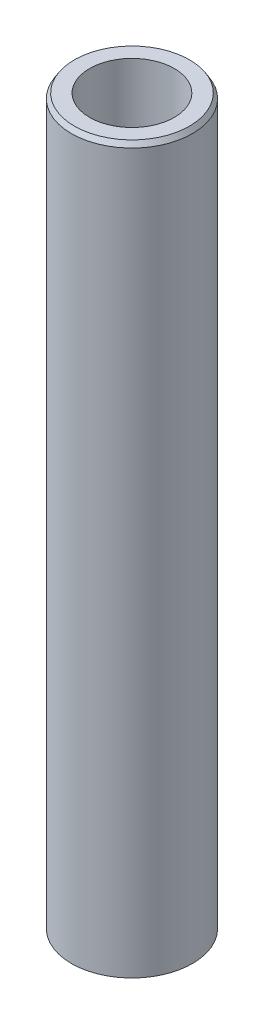
ISO-10303-21;
HEADER;
FILE_DESCRIPTION(('STEP AP214'),'2;1');
FILE_NAME('part.step','',(''),(''),'','','');
FILE_SCHEMA(('AUTOMOTIVE_DESIGN { 1 0 10303 214 1 1 1 1 }'));
ENDSEC;
DATA;
#1=APPLICATION_CONTEXT('core data for automotive mechanical design processes');
#2=APPLICATION_PROTOCOL_DEFINITION('international standard','automotive_design',2000,#1);
#3=PRODUCT_CONTEXT('',#1,'mechanical');
#4=PRODUCT('Part','Part','',(#3));
#5=PRODUCT_RELATED_PRODUCT_CATEGORY('part','',(#4));
#6=PRODUCT_DEFINITION_FORMATION('','',#4);
#7=PRODUCT_DEFINITION_CONTEXT('part definition',#1,'design');
#8=PRODUCT_DEFINITION('design','',#6,#7);
#9=PRODUCT_DEFINITION_SHAPE('','',#8);
#10=(LENGTH_UNIT() NAMED_UNIT(*) SI_UNIT(.MILLI.,.METRE.));
#11=(NAMED_UNIT(*) PLANE_ANGLE_UNIT() SI_UNIT($,.RADIAN.));
#12=(NAMED_UNIT(*) SI_UNIT($,.STERADIAN.) SOLID_ANGLE_UNIT());
#13=UNCERTAINTY_MEASURE_WITH_UNIT(LENGTH_MEASURE(1.E-05),#10,'distance_accuracy_value','');
#14=(GEOMETRIC_REPRESENTATION_CONTEXT(3) GLOBAL_UNCERTAINTY_ASSIGNED_CONTEXT((#13)) GLOBAL_UNIT_ASSIGNED_CONTEXT((#10,
#11,#12)) REPRESENTATION_CONTEXT('',''));
#15=CARTESIAN_POINT('',(0.,0.,0.));
#16=DIRECTION('',(0.,0.,1.));
#17=DIRECTION('',(1.,0.,0.));
#18=AXIS2_PLACEMENT_3D('',#15,#16,#17);
#19=CARTESIAN_POINT('',(0.,600.,0.));
#20=DIRECTION('',(0.,-1.,0.));
#21=DIRECTION('',(0.,0.,-1.));
#22=AXIS2_PLACEMENT_3D('',#19,#20,#21);
#23=CYLINDRICAL_SURFACE('',#22,50.);
#24=CARTESIAN_POINT('',(0.,595.939980837009,0.));
#25=DIRECTION('',(0.,1.,0.));
#26=DIRECTION('',(0.,0.,1.));
#27=AXIS2_PLACEMENT_3D('',#24,#25,#26);
#28=CIRCLE('',#27,50.);
#29=CARTESIAN_POINT('',(0.,595.939980837009,50.));
#30=VERTEX_POINT('',#29);
#31=EDGE_CURVE('E50',#30,#30,#28,.F.);
#32=ORIENTED_EDGE('',*,*,#31,.T.);
#33=EDGE_LOOP('',(#32));
#34=FACE_BOUND('',#33,.T.);
#35=CARTESIAN_POINT('',(0.,2.50672560015208,0.));
#36=DIRECTION('',(0.,1.,0.));
#37=DIRECTION('',(0.,0.,1.));
#38=AXIS2_PLACEMENT_3D('',#35,#36,#37);
#39=CIRCLE('',#38,50.);
#40=CARTESIAN_POINT('',(0.,2.50672560015208,50.));
#41=VERTEX_POINT('',#40);
#42=EDGE_CURVE('E51',#41,#41,#39,.T.);
#43=ORIENTED_EDGE('',*,*,#42,.T.);
#44=EDGE_LOOP('',(#43));
#45=FACE_BOUND('',#44,.T.);
#46=ADVANCED_FACE('F39',(#34,#45),#23,.T.);
#47=CARTESIAN_POINT('',(0.,600.,0.));
#48=DIRECTION('',(0.,1.,0.));
#49=DIRECTION('',(0.,0.,1.));
#50=AXIS2_PLACEMENT_3D('',#47,#48,#49);
#51=PLANE('',#50);
#52=CARTESIAN_POINT('',(0.,600.,0.));
#53=DIRECTION('',(0.,1.,0.));
#54=DIRECTION('',(0.,0.,1.));
#55=AXIS2_PLACEMENT_3D('',#52,#53,#54);
#56=CIRCLE('',#55,47.493274399848);
#57=CARTESIAN_POINT('',(0.,600.,47.493274399848));
#58=VERTEX_POINT('',#57);
#59=EDGE_CURVE('E54',#58,#58,#56,.T.);
#60=ORIENTED_EDGE('',*,*,#59,.T.);
#61=EDGE_LOOP('',(#60));
#62=FACE_BOUND('',#61,.T.);
#63=CARTESIAN_POINT('',(0.,600.,0.));
#64=DIRECTION('',(0.,1.,0.));
#65=DIRECTION('',(0.,0.,1.));
#66=AXIS2_PLACEMENT_3D('',#63,#64,#65);
#67=CIRCLE('',#66,34.9818370830786);
#68=CARTESIAN_POINT('',(0.,600.,34.9818370830786));
#69=VERTEX_POINT('',#68);
#70=EDGE_CURVE('E58',#69,#69,#67,.T.);
#71=ORIENTED_EDGE('',*,*,#70,.F.);
#72=EDGE_LOOP('',(#71));
#73=FACE_BOUND('',#72,.T.);
#74=ADVANCED_FACE('F69',(#62,#73),#51,.T.);
#75=CARTESIAN_POINT('',(0.,0.,0.));
#76=DIRECTION('',(0.,1.,0.));
#77=DIRECTION('',(0.,0.,1.));
#78=AXIS2_PLACEMENT_3D('',#75,#76,#77);
#79=PLANE('',#78);
#80=CARTESIAN_POINT('',(0.,0.,0.));
#81=DIRECTION('',(0.,1.,0.));
#82=DIRECTION('',(0.,0.,1.));
#83=AXIS2_PLACEMENT_3D('',#80,#81,#82);
#84=CIRCLE('',#83,45.9399808370092);
#85=CARTESIAN_POINT('',(0.,0.,45.9399808370092));
#86=VERTEX_POINT('',#85);
#87=EDGE_CURVE('E10',#86,#86,#84,.F.);
#88=ORIENTED_EDGE('',*,*,#87,.T.);
#89=EDGE_LOOP('',(#88));
#90=FACE_BOUND('',#89,.T.);
#91=CARTESIAN_POINT('',(0.,0.,0.));
#92=DIRECTION('',(0.,1.,0.));
#93=DIRECTION('',(0.,0.,1.));
#94=AXIS2_PLACEMENT_3D('',#91,#92,#93);
#95=CIRCLE('',#94,34.9818370830786);
#96=CARTESIAN_POINT('',(0.,0.,34.9818370830786));
#97=VERTEX_POINT('',#96);
#98=EDGE_CURVE('E63',#97,#97,#95,.T.);
#99=ORIENTED_EDGE('',*,*,#98,.T.);
#100=EDGE_LOOP('',(#99));
#101=FACE_BOUND('',#100,.T.);
#102=ADVANCED_FACE('F75',(#90,#101),#79,.F.);
#103=CARTESIAN_POINT('',(0.,600.,0.));
#104=DIRECTION('',(0.,-1.,0.));
#105=DIRECTION('',(0.,0.,-1.));
#106=AXIS2_PLACEMENT_3D('',#103,#104,#105);
#107=CYLINDRICAL_SURFACE('',#106,34.9818370830786);
#108=ORIENTED_EDGE('',*,*,#70,.T.);
#109=EDGE_LOOP('',(#108));
#110=FACE_BOUND('',#109,.T.);
#111=ORIENTED_EDGE('',*,*,#98,.F.);
#112=EDGE_LOOP('',(#111));
#113=FACE_BOUND('',#112,.T.);
#114=ADVANCED_FACE('F70',(#110,#113),#107,.F.);
#115=CARTESIAN_POINT('',(0.,600.,0.));
#116=DIRECTION('',(0.,-1.,0.));
#117=DIRECTION('',(0.,0.,-1.));
#118=AXIS2_PLACEMENT_3D('',#115,#116,#117);
#119=CONICAL_SURFACE('',#118,47.493274399848,0.553127911944052);
#120=ORIENTED_EDGE('',*,*,#31,.F.);
#121=EDGE_LOOP('',(#120));
#122=FACE_BOUND('',#121,.T.);
#123=ORIENTED_EDGE('',*,*,#59,.F.);
#124=EDGE_LOOP('',(#123));
#125=FACE_BOUND('',#124,.T.);
#126=ADVANCED_FACE('F81',(#122,#125),#119,.T.);
#127=CARTESIAN_POINT('',(0.,2.50672560015208,0.));
#128=DIRECTION('',(0.,1.,0.));
#129=DIRECTION('',(0.,0.,1.));
#130=AXIS2_PLACEMENT_3D('',#127,#128,#129);
#131=CONICAL_SURFACE('',#130,50.,1.01766841485085);
#132=CARTESIAN_POINT('',(0.,0.,45.9399808370092));
#133=CARTESIAN_POINT('',(0.,0.0261117250015845,45.9822727032903));
#134=CARTESIAN_POINT('',(0.,0.0522234500031686,46.0245645695715));
#135=CARTESIAN_POINT('',(0.,0.104446900006337,46.1091483021338));
#136=CARTESIAN_POINT('',(0.,0.130558625007921,46.1514401684149));
#137=CARTESIAN_POINT('',(0.,0.182782075011089,46.2360239009773));
#138=CARTESIAN_POINT('',(0.,0.208893800012672,46.2783157672584));
#139=CARTESIAN_POINT('',(0.,0.261117250015841,46.3628994998207));
#140=CARTESIAN_POINT('',(0.,0.287228975017426,46.4051913661019));
#141=CARTESIAN_POINT('',(0.,0.339452425020594,46.4897750986642));
#142=CARTESIAN_POINT('',(0.,0.365564150022178,46.5320669649453));
#143=CARTESIAN_POINT('',(0.,0.417787600025346,46.6166506975076));
#144=CARTESIAN_POINT('',(0.,0.443899325026931,46.6589425637888));
#145=CARTESIAN_POINT('',(0.,0.4961227750301,46.7435262963511));
#146=CARTESIAN_POINT('',(0.,0.522234500031683,46.7858181626323));
#147=CARTESIAN_POINT('',(0.,0.574457950034851,46.8704018951946));
#148=CARTESIAN_POINT('',(0.,0.600569675036436,46.9126937614757));
#149=CARTESIAN_POINT('',(0.,0.652793125039605,46.997277494038));
#150=CARTESIAN_POINT('',(0.,0.678904850041189,47.0395693603192));
#151=CARTESIAN_POINT('',(0.,0.731128300044356,47.1241530928815));
#152=CARTESIAN_POINT('',(0.,0.75724002504594,47.1664449591627));
#153=CARTESIAN_POINT('',(0.,0.809463475049109,47.251028691725));
#154=CARTESIAN_POINT('',(0.,0.835575200050694,47.2933205580061));
#155=CARTESIAN_POINT('',(0.,0.887798650053863,47.3779042905684));
#156=CARTESIAN_POINT('',(0.,0.913910375055446,47.4201961568496));
#157=CARTESIAN_POINT('',(0.,0.966133825058614,47.5047798894119));
#158=CARTESIAN_POINT('',(0.,0.9922455500602,47.547071755693));
#159=CARTESIAN_POINT('',(0.,1.04446900006337,47.6316554882554));
#160=CARTESIAN_POINT('',(0.,1.07058072506495,47.6739473545365));
#161=CARTESIAN_POINT('',(0.,1.12280417506812,47.7585310870988));
#162=CARTESIAN_POINT('',(0.,1.1489159000697,47.80082295338));
#163=CARTESIAN_POINT('',(0.,1.20113935007287,47.8854066859423));
#164=CARTESIAN_POINT('',(0.,1.22725107507446,47.9276985522234));
#165=CARTESIAN_POINT('',(0.,1.27947452507762,48.0122822847857));
#166=CARTESIAN_POINT('',(0.,1.30558625007921,48.0545741510669));
#167=CARTESIAN_POINT('',(0.,1.35780970008238,48.1391578836292));
#168=CARTESIAN_POINT('',(0.,1.38392142508396,48.1814497499104));
#169=CARTESIAN_POINT('',(0.,1.43614487508713,48.2660334824727));
#170=CARTESIAN_POINT('',(0.,1.46225660008871,48.3083253487538));
#171=CARTESIAN_POINT('',(0.,1.51448005009188,48.3929090813161));
#172=CARTESIAN_POINT('',(0.,1.54059177509347,48.4352009475973));
#173=CARTESIAN_POINT('',(0.,1.59281522509664,48.5197846801596));
#174=CARTESIAN_POINT('',(0.,1.61892695009822,48.5620765464407));
#175=CARTESIAN_POINT('',(0.,1.67115040010139,48.6466602790031));
#176=CARTESIAN_POINT('',(0.,1.69726212510297,48.6889521452842));
#177=CARTESIAN_POINT('',(0.,1.74948557510614,48.7735358778465));
#178=CARTESIAN_POINT('',(0.,1.77559730010772,48.8158277441277));
#179=CARTESIAN_POINT('',(0.,1.82782075011089,48.90041147669));
#180=CARTESIAN_POINT('',(0.,1.85393247511248,48.9427033429711));
#181=CARTESIAN_POINT('',(0.,1.90615592511565,49.0272870755335));
#182=CARTESIAN_POINT('',(0.,1.93226765011723,49.0695789418146));
#183=CARTESIAN_POINT('',(0.,1.9844911001204,49.1541626743769));
#184=CARTESIAN_POINT('',(0.,2.01060282512198,49.1964545406581));
#185=CARTESIAN_POINT('',(0.,2.06282627512515,49.2810382732204));
#186=CARTESIAN_POINT('',(0.,2.08893800012674,49.3233301395015));
#187=CARTESIAN_POINT('',(0.,2.1411614501299,49.4079138720638));
#188=CARTESIAN_POINT('',(0.,2.16727317513149,49.450205738345));
#189=CARTESIAN_POINT('',(0.,2.21949662513466,49.5347894709073));
#190=CARTESIAN_POINT('',(0.,2.24560835013624,49.5770813371885));
#191=CARTESIAN_POINT('',(0.,2.29783180013941,49.6616650697508));
#192=CARTESIAN_POINT('',(0.,2.32394352514099,49.7039569360319));
#193=CARTESIAN_POINT('',(0.,2.37616697514416,49.7885406685942));
#194=CARTESIAN_POINT('',(0.,2.40227870014575,49.8308325348754));
#195=CARTESIAN_POINT('',(0.,2.45450215014891,49.9154162674377));
#196=CARTESIAN_POINT('',(0.,2.4806138751505,49.9577081337188));
#197=CARTESIAN_POINT('',(0.,2.50672560015208,50.));
#198=B_SPLINE_CURVE_WITH_KNOTS('',3,(#132,#133,#134,#135,#136,#137,#138,#139,#140,#141,#142,
#143,#144,#145,#146,#147,#148,#149,#150,#151,#152,#153,#154,#155,#156,#157,#158,#159,#160,#161,
#162,#163,#164,#165,#166,#167,#168,#169,#170,#171,#172,#173,#174,#175,#176,#177,#178,#179,#180,
#181,#182,#183,#184,#185,#186,#187,#188,#189,#190,#191,#192,#193,#194,#195,#196,#197),
.UNSPECIFIED.,.F.,.F.,(4,2,2,2,2,2,2,2,2,2,2,2,2,2,2,2,2,2,2,2,2,2,2,2,2,2,2,2,2,2,2,2,4),(0.,
0.149110084249563,0.298220168499131,0.4473302527487,0.596440336998262,0.745550421247831,
0.894660505497393,1.04377058974696,1.19288067399652,1.34199075824609,1.49110084249566,
1.64021092674522,1.78932101099479,1.93843109524436,2.08754117949392,2.23665126374349,
2.38576134799306,2.53487143224262,2.68398151649219,2.83309160074176,2.98220168499132,
3.13131176924089,3.28042185349045,3.42953193774002,3.57864202198958,3.72775210623915,
3.87686219048872,4.02597227473828,4.17508235898785,4.32419244323741,4.47330252748698,
4.62241261173654,4.77152269598611),.UNSPECIFIED.);
#199=EDGE_CURVE('BSEAM45',#86,#41,#198,.T.);
#200=ORIENTED_EDGE('',*,*,#87,.F.);
#201=ORIENTED_EDGE('',*,*,#42,.F.);
#202=ORIENTED_EDGE('',*,*,#199,.T.);
#203=ORIENTED_EDGE('',*,*,#199,.F.);
#204=EDGE_LOOP('',(#200,#202,#201,#203));
#205=FACE_BOUND('',#204,.T.);
#206=ADVANCED_FACE('F45',(#205),#131,.T.);
#207=CLOSED_SHELL('',(#46,#74,#102,#114,#126,#206));
#208=MANIFOLD_SOLID_BREP('B2',#207);
#209=ADVANCED_BREP_SHAPE_REPRESENTATION('',(#18,#208),#14);
#210=SHAPE_DEFINITION_REPRESENTATION(#9,#209);
ENDSEC;
END-ISO-10303-21;
